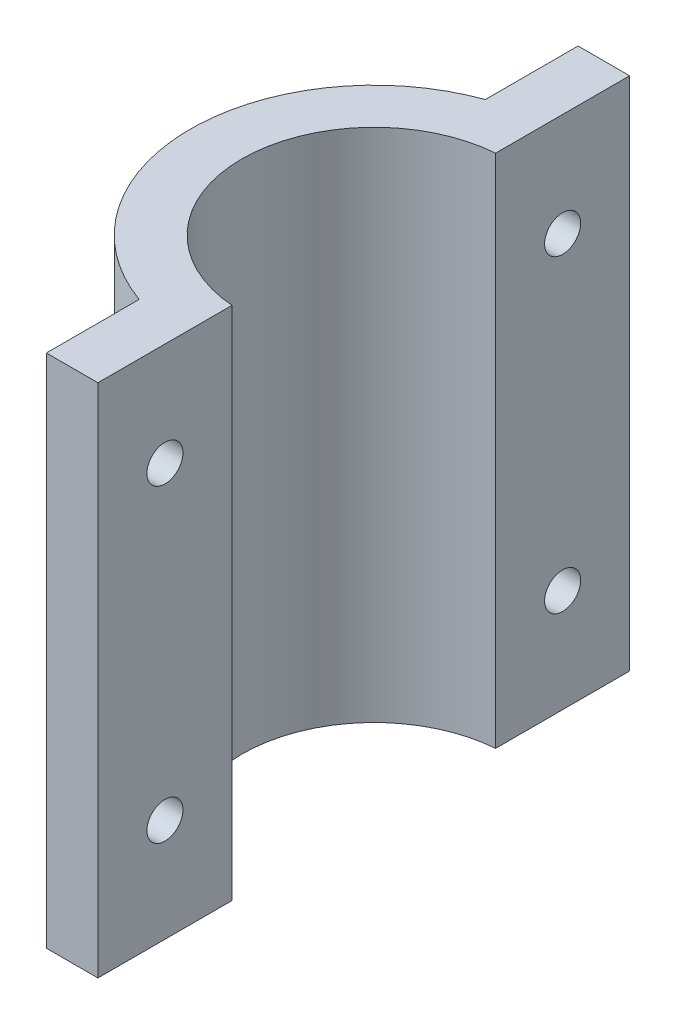
ISO-10303-21;
HEADER;
FILE_DESCRIPTION(('STEP AP214'),'2;1');
FILE_NAME('part.step','',(''),(''),'','','');
FILE_SCHEMA(('AUTOMOTIVE_DESIGN { 1 0 10303 214 1 1 1 1 }'));
ENDSEC;
DATA;
#1=APPLICATION_CONTEXT('core data for automotive mechanical design processes');
#2=APPLICATION_PROTOCOL_DEFINITION('international standard','automotive_design',2000,#1);
#3=PRODUCT_CONTEXT('',#1,'mechanical');
#4=PRODUCT('Part','Part','',(#3));
#5=PRODUCT_RELATED_PRODUCT_CATEGORY('part','',(#4));
#6=PRODUCT_DEFINITION_FORMATION('','',#4);
#7=PRODUCT_DEFINITION_CONTEXT('part definition',#1,'design');
#8=PRODUCT_DEFINITION('design','',#6,#7);
#9=PRODUCT_DEFINITION_SHAPE('','',#8);
#10=(LENGTH_UNIT() NAMED_UNIT(*) SI_UNIT(.MILLI.,.METRE.));
#11=(NAMED_UNIT(*) PLANE_ANGLE_UNIT() SI_UNIT($,.RADIAN.));
#12=(NAMED_UNIT(*) SI_UNIT($,.STERADIAN.) SOLID_ANGLE_UNIT());
#13=UNCERTAINTY_MEASURE_WITH_UNIT(LENGTH_MEASURE(1.E-05),#10,'distance_accuracy_value','');
#14=(GEOMETRIC_REPRESENTATION_CONTEXT(3) GLOBAL_UNCERTAINTY_ASSIGNED_CONTEXT((#13)) GLOBAL_UNIT_ASSIGNED_CONTEXT((#10,
#11,#12)) REPRESENTATION_CONTEXT('',''));
#15=CARTESIAN_POINT('',(0.,0.,0.));
#16=DIRECTION('',(0.,0.,1.));
#17=DIRECTION('',(1.,0.,0.));
#18=AXIS2_PLACEMENT_3D('',#15,#16,#17);
#19=CARTESIAN_POINT('',(-1.,-50.,25.7848331835619));
#20=DIRECTION('',(0.,0.,-1.));
#21=DIRECTION('',(-1.,0.,0.));
#22=AXIS2_PLACEMENT_3D('',#19,#20,#21);
#23=PLANE('',#22);
#24=DIRECTION('',(-1.,0.,0.));
#25=VECTOR('',#24,1.);
#26=CARTESIAN_POINT('',(-1.,0.,25.7848331835619));
#27=LINE('',#26,#25);
#28=CARTESIAN_POINT('',(-1.,0.,25.7848331835619));
#29=VERTEX_POINT('',#28);
#30=CARTESIAN_POINT('',(-6.,0.,25.7848331835619));
#31=VERTEX_POINT('',#30);
#32=EDGE_CURVE('E146',#29,#31,#27,.T.);
#33=ORIENTED_EDGE('',*,*,#32,.T.);
#34=DIRECTION('',(0.,1.,0.));
#35=VECTOR('',#34,1.);
#36=CARTESIAN_POINT('',(-6.,-50.,25.7848331835619));
#37=LINE('',#36,#35);
#38=CARTESIAN_POINT('',(-6.,-50.,25.7848331835619));
#39=VERTEX_POINT('',#38);
#40=EDGE_CURVE('E11',#39,#31,#37,.T.);
#41=ORIENTED_EDGE('',*,*,#40,.F.);
#42=DIRECTION('',(-1.,0.,0.));
#43=VECTOR('',#42,1.);
#44=CARTESIAN_POINT('',(-1.,-50.,25.7848331835619));
#45=LINE('',#44,#43);
#46=CARTESIAN_POINT('',(-1.,-50.,25.7848331835619));
#47=VERTEX_POINT('',#46);
#48=EDGE_CURVE('E169',#47,#39,#45,.T.);
#49=ORIENTED_EDGE('',*,*,#48,.F.);
#50=DIRECTION('',(0.,1.,0.));
#51=VECTOR('',#50,1.);
#52=CARTESIAN_POINT('',(-1.,-50.,25.7848331835619));
#53=LINE('',#52,#51);
#54=EDGE_CURVE('E142',#47,#29,#53,.T.);
#55=ORIENTED_EDGE('',*,*,#54,.T.);
#56=EDGE_LOOP('',(#33,#41,#49,#55));
#57=FACE_BOUND('',#56,.T.);
#58=ADVANCED_FACE('F45',(#57),#23,.F.);
#59=CARTESIAN_POINT('',(-6.,-50.,25.7848331835619));
#60=DIRECTION('',(1.,0.,0.));
#61=DIRECTION('',(0.,0.,-1.));
#62=AXIS2_PLACEMENT_3D('',#59,#60,#61);
#63=PLANE('',#62);
#64=CARTESIAN_POINT('',(-6.,-40.,19.2853936956035));
#65=DIRECTION('',(1.,0.,0.));
#66=DIRECTION('',(0.,0.,-1.));
#67=AXIS2_PLACEMENT_3D('',#64,#65,#66);
#68=CIRCLE('',#67,1.75);
#69=CARTESIAN_POINT('',(-6.,-40.,17.5353936956035));
#70=VERTEX_POINT('',#69);
#71=EDGE_CURVE('E220',#70,#70,#68,.T.);
#72=ORIENTED_EDGE('',*,*,#71,.T.);
#73=EDGE_LOOP('',(#72));
#74=FACE_BOUND('',#73,.T.);
#75=CARTESIAN_POINT('',(-6.,-10.,19.2853936956035));
#76=DIRECTION('',(1.,0.,0.));
#77=DIRECTION('',(0.,0.,-1.));
#78=AXIS2_PLACEMENT_3D('',#75,#76,#77);
#79=CIRCLE('',#78,1.75);
#80=CARTESIAN_POINT('',(-6.,-10.,17.5353936956035));
#81=VERTEX_POINT('',#80);
#82=EDGE_CURVE('E224',#81,#81,#79,.T.);
#83=ORIENTED_EDGE('',*,*,#82,.T.);
#84=EDGE_LOOP('',(#83));
#85=FACE_BOUND('',#84,.T.);
#86=DIRECTION('',(0.,0.,-1.));
#87=VECTOR('',#86,1.);
#88=CARTESIAN_POINT('',(-6.,0.,25.7848331835619));
#89=LINE('',#88,#87);
#90=CARTESIAN_POINT('',(-5.99999999999999,0.,16.7848331835619));
#91=VERTEX_POINT('',#90);
#92=EDGE_CURVE('E150',#31,#91,#89,.T.);
#93=ORIENTED_EDGE('',*,*,#92,.T.);
#94=DIRECTION('',(0.,1.,0.));
#95=VECTOR('',#94,1.);
#96=CARTESIAN_POINT('',(-5.99999999999999,-50.,16.7848331835619));
#97=LINE('',#96,#95);
#98=CARTESIAN_POINT('',(-5.99999999999999,-50.,16.7848331835619));
#99=VERTEX_POINT('',#98);
#100=EDGE_CURVE('E54',#99,#91,#97,.T.);
#101=ORIENTED_EDGE('',*,*,#100,.F.);
#102=DIRECTION('',(0.,0.,-1.));
#103=VECTOR('',#102,1.);
#104=CARTESIAN_POINT('',(-6.,-50.,25.7848331835619));
#105=LINE('',#104,#103);
#106=EDGE_CURVE('E105',#39,#99,#105,.T.);
#107=ORIENTED_EDGE('',*,*,#106,.F.);
#108=ORIENTED_EDGE('',*,*,#40,.T.);
#109=EDGE_LOOP('',(#93,#101,#107,#108));
#110=FACE_BOUND('',#109,.T.);
#111=ADVANCED_FACE('F260',(#74,#85,#110),#63,.F.);
#112=CARTESIAN_POINT('',(0.,-50.,0.));
#113=DIRECTION('',(0.,1.,0.));
#114=DIRECTION('',(0.,0.,1.));
#115=AXIS2_PLACEMENT_3D('',#112,#113,#114);
#116=CYLINDRICAL_SURFACE('',#115,17.825);
#117=CARTESIAN_POINT('',(0.,0.,0.));
#118=DIRECTION('',(0.,-1.,0.));
#119=DIRECTION('',(0.,0.,-1.));
#120=AXIS2_PLACEMENT_3D('',#117,#118,#119);
#121=CIRCLE('',#120,17.825);
#122=CARTESIAN_POINT('',(-6.,0.,-16.7848331835619));
#123=VERTEX_POINT('',#122);
#124=EDGE_CURVE('E154',#91,#123,#121,.T.);
#125=ORIENTED_EDGE('',*,*,#124,.T.);
#126=DIRECTION('',(0.,1.,0.));
#127=VECTOR('',#126,1.);
#128=CARTESIAN_POINT('',(-6.,-50.,-16.7848331835619));
#129=LINE('',#128,#127);
#130=CARTESIAN_POINT('',(-6.,-50.,-16.7848331835619));
#131=VERTEX_POINT('',#130);
#132=EDGE_CURVE('E180',#131,#123,#129,.T.);
#133=ORIENTED_EDGE('',*,*,#132,.F.);
#134=CARTESIAN_POINT('',(0.,-50.,0.));
#135=DIRECTION('',(0.,-1.,0.));
#136=DIRECTION('',(0.,0.,-1.));
#137=AXIS2_PLACEMENT_3D('',#134,#135,#136);
#138=CIRCLE('',#137,17.825);
#139=EDGE_CURVE('E190',#99,#131,#138,.T.);
#140=ORIENTED_EDGE('',*,*,#139,.F.);
#141=ORIENTED_EDGE('',*,*,#100,.T.);
#142=EDGE_LOOP('',(#125,#133,#140,#141));
#143=FACE_BOUND('',#142,.T.);
#144=ADVANCED_FACE('F188',(#143),#116,.T.);
#145=CARTESIAN_POINT('',(-6.,-50.,-16.7848331835619));
#146=DIRECTION('',(1.,0.,0.));
#147=DIRECTION('',(0.,0.,-1.));
#148=AXIS2_PLACEMENT_3D('',#145,#146,#147);
#149=PLANE('',#148);
#150=CARTESIAN_POINT('',(-6.,-10.,-19.2853936956035));
#151=DIRECTION('',(1.,0.,0.));
#152=DIRECTION('',(0.,0.,-1.));
#153=AXIS2_PLACEMENT_3D('',#150,#151,#152);
#154=CIRCLE('',#153,1.75000000000001);
#155=CARTESIAN_POINT('',(-6.,-10.,-21.0353936956035));
#156=VERTEX_POINT('',#155);
#157=EDGE_CURVE('E151',#156,#156,#154,.T.);
#158=ORIENTED_EDGE('',*,*,#157,.T.);
#159=EDGE_LOOP('',(#158));
#160=FACE_BOUND('',#159,.T.);
#161=CARTESIAN_POINT('',(-6.,-40.,-19.2853936956035));
#162=DIRECTION('',(1.,0.,0.));
#163=DIRECTION('',(0.,0.,-1.));
#164=AXIS2_PLACEMENT_3D('',#161,#162,#163);
#165=CIRCLE('',#164,1.75000000000001);
#166=CARTESIAN_POINT('',(-6.,-40.,-21.0353936956036));
#167=VERTEX_POINT('',#166);
#168=EDGE_CURVE('E216',#167,#167,#165,.T.);
#169=ORIENTED_EDGE('',*,*,#168,.T.);
#170=EDGE_LOOP('',(#169));
#171=FACE_BOUND('',#170,.T.);
#172=DIRECTION('',(0.,0.,-1.));
#173=VECTOR('',#172,1.);
#174=CARTESIAN_POINT('',(-6.,0.,-16.7848331835619));
#175=LINE('',#174,#173);
#176=CARTESIAN_POINT('',(-6.,0.,-25.7848331835619));
#177=VERTEX_POINT('',#176);
#178=EDGE_CURVE('E157',#123,#177,#175,.T.);
#179=ORIENTED_EDGE('',*,*,#178,.T.);
#180=DIRECTION('',(0.,1.,0.));
#181=VECTOR('',#180,1.);
#182=CARTESIAN_POINT('',(-6.,-50.,-25.7848331835619));
#183=LINE('',#182,#181);
#184=CARTESIAN_POINT('',(-6.,-50.,-25.7848331835619));
#185=VERTEX_POINT('',#184);
#186=EDGE_CURVE('E176',#185,#177,#183,.T.);
#187=ORIENTED_EDGE('',*,*,#186,.F.);
#188=DIRECTION('',(0.,0.,-1.));
#189=VECTOR('',#188,1.);
#190=CARTESIAN_POINT('',(-6.,-50.,-16.7848331835619));
#191=LINE('',#190,#189);
#192=EDGE_CURVE('E203',#131,#185,#191,.T.);
#193=ORIENTED_EDGE('',*,*,#192,.F.);
#194=ORIENTED_EDGE('',*,*,#132,.T.);
#195=EDGE_LOOP('',(#179,#187,#193,#194));
#196=FACE_BOUND('',#195,.T.);
#197=ADVANCED_FACE('F198',(#160,#171,#196),#149,.F.);
#198=CARTESIAN_POINT('',(-6.,-50.,-25.7848331835619));
#199=DIRECTION('',(0.,0.,1.));
#200=DIRECTION('',(1.,0.,0.));
#201=AXIS2_PLACEMENT_3D('',#198,#199,#200);
#202=PLANE('',#201);
#203=DIRECTION('',(1.,0.,0.));
#204=VECTOR('',#203,1.);
#205=CARTESIAN_POINT('',(-6.,0.,-25.7848331835619));
#206=LINE('',#205,#204);
#207=CARTESIAN_POINT('',(-1.,0.,-25.7848331835619));
#208=VERTEX_POINT('',#207);
#209=EDGE_CURVE('E160',#177,#208,#206,.T.);
#210=ORIENTED_EDGE('',*,*,#209,.T.);
#211=DIRECTION('',(0.,1.,0.));
#212=VECTOR('',#211,1.);
#213=CARTESIAN_POINT('',(-1.,-50.,-25.7848331835619));
#214=LINE('',#213,#212);
#215=CARTESIAN_POINT('',(-1.,-50.,-25.7848331835619));
#216=VERTEX_POINT('',#215);
#217=EDGE_CURVE('E135',#216,#208,#214,.T.);
#218=ORIENTED_EDGE('',*,*,#217,.F.);
#219=DIRECTION('',(1.,0.,0.));
#220=VECTOR('',#219,1.);
#221=CARTESIAN_POINT('',(-6.,-50.,-25.7848331835619));
#222=LINE('',#221,#220);
#223=EDGE_CURVE('E124',#185,#216,#222,.T.);
#224=ORIENTED_EDGE('',*,*,#223,.F.);
#225=ORIENTED_EDGE('',*,*,#186,.T.);
#226=EDGE_LOOP('',(#210,#218,#224,#225));
#227=FACE_BOUND('',#226,.T.);
#228=ADVANCED_FACE('F201',(#227),#202,.F.);
#229=CARTESIAN_POINT('',(-1.,-50.,-25.7848331835619));
#230=DIRECTION('',(-1.,0.,0.));
#231=DIRECTION('',(0.,0.,1.));
#232=AXIS2_PLACEMENT_3D('',#229,#230,#231);
#233=PLANE('',#232);
#234=CARTESIAN_POINT('',(-1.,-10.,-19.2853936956035));
#235=DIRECTION('',(1.,0.,0.));
#236=DIRECTION('',(0.,0.,1.));
#237=AXIS2_PLACEMENT_3D('',#234,#235,#236);
#238=CIRCLE('',#237,1.75000000000001);
#239=CARTESIAN_POINT('',(-1.,-10.,-17.5353936956035));
#240=VERTEX_POINT('',#239);
#241=EDGE_CURVE('E233',#240,#240,#238,.T.);
#242=ORIENTED_EDGE('',*,*,#241,.F.);
#243=EDGE_LOOP('',(#242));
#244=FACE_BOUND('',#243,.T.);
#245=CARTESIAN_POINT('',(-1.,-40.,-19.2853936956035));
#246=DIRECTION('',(1.,0.,0.));
#247=DIRECTION('',(0.,0.,-1.));
#248=AXIS2_PLACEMENT_3D('',#245,#246,#247);
#249=CIRCLE('',#248,1.75000000000001);
#250=CARTESIAN_POINT('',(-1.,-40.,-21.0353936956036));
#251=VERTEX_POINT('',#250);
#252=EDGE_CURVE('E237',#251,#251,#249,.T.);
#253=ORIENTED_EDGE('',*,*,#252,.F.);
#254=EDGE_LOOP('',(#253));
#255=FACE_BOUND('',#254,.T.);
#256=DIRECTION('',(0.,0.,1.));
#257=VECTOR('',#256,1.);
#258=CARTESIAN_POINT('',(-1.,0.,-25.7848331835619));
#259=LINE('',#258,#257);
#260=CARTESIAN_POINT('',(-1.00000000000001,0.,-12.7859542076452));
#261=VERTEX_POINT('',#260);
#262=EDGE_CURVE('E133',#208,#261,#259,.T.);
#263=ORIENTED_EDGE('',*,*,#262,.T.);
#264=DIRECTION('',(0.,1.,0.));
#265=VECTOR('',#264,1.);
#266=CARTESIAN_POINT('',(-1.00000000000001,-50.,-12.7859542076452));
#267=LINE('',#266,#265);
#268=CARTESIAN_POINT('',(-1.00000000000001,-50.,-12.7859542076452));
#269=VERTEX_POINT('',#268);
#270=EDGE_CURVE('E130',#269,#261,#267,.T.);
#271=ORIENTED_EDGE('',*,*,#270,.F.);
#272=DIRECTION('',(0.,0.,1.));
#273=VECTOR('',#272,1.);
#274=CARTESIAN_POINT('',(-1.,-50.,-25.7848331835619));
#275=LINE('',#274,#273);
#276=EDGE_CURVE('E118',#216,#269,#275,.T.);
#277=ORIENTED_EDGE('',*,*,#276,.F.);
#278=ORIENTED_EDGE('',*,*,#217,.T.);
#279=EDGE_LOOP('',(#263,#271,#277,#278));
#280=FACE_BOUND('',#279,.T.);
#281=ADVANCED_FACE('F131',(#244,#255,#280),#233,.F.);
#282=CARTESIAN_POINT('',(0.,-50.,0.));
#283=DIRECTION('',(0.,1.,0.));
#284=DIRECTION('',(0.,0.,1.));
#285=AXIS2_PLACEMENT_3D('',#282,#283,#284);
#286=CYLINDRICAL_SURFACE('',#285,12.825);
#287=CARTESIAN_POINT('',(0.,0.,0.));
#288=DIRECTION('',(0.,1.,0.));
#289=DIRECTION('',(0.,0.,-1.));
#290=AXIS2_PLACEMENT_3D('',#287,#288,#289);
#291=CIRCLE('',#290,12.825);
#292=CARTESIAN_POINT('',(-1.,0.,12.7859542076452));
#293=VERTEX_POINT('',#292);
#294=EDGE_CURVE('E91',#261,#293,#291,.T.);
#295=ORIENTED_EDGE('',*,*,#294,.T.);
#296=DIRECTION('',(0.,1.,0.));
#297=VECTOR('',#296,1.);
#298=CARTESIAN_POINT('',(-1.,-50.,12.7859542076452));
#299=LINE('',#298,#297);
#300=CARTESIAN_POINT('',(-1.,-50.,12.7859542076452));
#301=VERTEX_POINT('',#300);
#302=EDGE_CURVE('E136',#301,#293,#299,.T.);
#303=ORIENTED_EDGE('',*,*,#302,.F.);
#304=CARTESIAN_POINT('',(0.,-50.,0.));
#305=DIRECTION('',(0.,1.,0.));
#306=DIRECTION('',(0.,0.,-1.));
#307=AXIS2_PLACEMENT_3D('',#304,#305,#306);
#308=CIRCLE('',#307,12.825);
#309=EDGE_CURVE('E122',#269,#301,#308,.T.);
#310=ORIENTED_EDGE('',*,*,#309,.F.);
#311=ORIENTED_EDGE('',*,*,#270,.T.);
#312=EDGE_LOOP('',(#295,#303,#310,#311));
#313=FACE_BOUND('',#312,.T.);
#314=ADVANCED_FACE('F138',(#313),#286,.F.);
#315=CARTESIAN_POINT('',(-1.,-50.,25.7848331835619));
#316=DIRECTION('',(-1.,0.,0.));
#317=DIRECTION('',(0.,0.,1.));
#318=AXIS2_PLACEMENT_3D('',#315,#316,#317);
#319=PLANE('',#318);
#320=CARTESIAN_POINT('',(-1.,-40.,19.2853936956035));
#321=DIRECTION('',(1.,0.,0.));
#322=DIRECTION('',(0.,0.,1.));
#323=AXIS2_PLACEMENT_3D('',#320,#321,#322);
#324=CIRCLE('',#323,1.75);
#325=CARTESIAN_POINT('',(-1.,-40.,21.0353936956035));
#326=VERTEX_POINT('',#325);
#327=EDGE_CURVE('E232',#326,#326,#324,.T.);
#328=ORIENTED_EDGE('',*,*,#327,.F.);
#329=EDGE_LOOP('',(#328));
#330=FACE_BOUND('',#329,.T.);
#331=CARTESIAN_POINT('',(-1.,-10.,19.2853936956035));
#332=DIRECTION('',(1.,0.,0.));
#333=DIRECTION('',(0.,0.,-1.));
#334=AXIS2_PLACEMENT_3D('',#331,#332,#333);
#335=CIRCLE('',#334,1.75);
#336=CARTESIAN_POINT('',(-1.,-10.,17.5353936956035));
#337=VERTEX_POINT('',#336);
#338=EDGE_CURVE('E228',#337,#337,#335,.T.);
#339=ORIENTED_EDGE('',*,*,#338,.F.);
#340=EDGE_LOOP('',(#339));
#341=FACE_BOUND('',#340,.T.);
#342=DIRECTION('',(0.,0.,1.));
#343=VECTOR('',#342,1.);
#344=CARTESIAN_POINT('',(-1.,0.,25.7848331835619));
#345=LINE('',#344,#343);
#346=EDGE_CURVE('E97',#293,#29,#345,.T.);
#347=ORIENTED_EDGE('',*,*,#346,.T.);
#348=ORIENTED_EDGE('',*,*,#54,.F.);
#349=DIRECTION('',(0.,0.,1.));
#350=VECTOR('',#349,1.);
#351=CARTESIAN_POINT('',(-1.,-50.,25.7848331835619));
#352=LINE('',#351,#350);
#353=EDGE_CURVE('E62',#301,#47,#352,.T.);
#354=ORIENTED_EDGE('',*,*,#353,.F.);
#355=ORIENTED_EDGE('',*,*,#302,.T.);
#356=EDGE_LOOP('',(#347,#348,#354,#355));
#357=FACE_BOUND('',#356,.T.);
#358=ADVANCED_FACE('F248',(#330,#341,#357),#319,.F.);
#359=CARTESIAN_POINT('',(0.,-50.,0.));
#360=DIRECTION('',(0.,-1.,0.));
#361=DIRECTION('',(0.,0.,-1.));
#362=AXIS2_PLACEMENT_3D('',#359,#360,#361);
#363=PLANE('',#362);
#364=ORIENTED_EDGE('',*,*,#48,.T.);
#365=ORIENTED_EDGE('',*,*,#106,.T.);
#366=ORIENTED_EDGE('',*,*,#139,.T.);
#367=ORIENTED_EDGE('',*,*,#192,.T.);
#368=ORIENTED_EDGE('',*,*,#223,.T.);
#369=ORIENTED_EDGE('',*,*,#276,.T.);
#370=ORIENTED_EDGE('',*,*,#309,.T.);
#371=ORIENTED_EDGE('',*,*,#353,.T.);
#372=EDGE_LOOP('',(#364,#365,#366,#367,#368,#369,#370,#371));
#373=FACE_BOUND('',#372,.T.);
#374=ADVANCED_FACE('F120',(#373),#363,.T.);
#375=CARTESIAN_POINT('',(0.,0.,0.));
#376=DIRECTION('',(0.,-1.,0.));
#377=DIRECTION('',(0.,0.,-1.));
#378=AXIS2_PLACEMENT_3D('',#375,#376,#377);
#379=PLANE('',#378);
#380=ORIENTED_EDGE('',*,*,#32,.F.);
#381=ORIENTED_EDGE('',*,*,#346,.F.);
#382=ORIENTED_EDGE('',*,*,#294,.F.);
#383=ORIENTED_EDGE('',*,*,#262,.F.);
#384=ORIENTED_EDGE('',*,*,#209,.F.);
#385=ORIENTED_EDGE('',*,*,#178,.F.);
#386=ORIENTED_EDGE('',*,*,#124,.F.);
#387=ORIENTED_EDGE('',*,*,#92,.F.);
#388=EDGE_LOOP('',(#380,#381,#382,#383,#384,#385,#386,#387));
#389=FACE_BOUND('',#388,.T.);
#390=ADVANCED_FACE('F194',(#389),#379,.F.);
#391=CARTESIAN_POINT('',(-17.825,-10.,19.2853936956035));
#392=DIRECTION('',(1.,0.,0.));
#393=DIRECTION('',(0.,0.,-1.));
#394=AXIS2_PLACEMENT_3D('',#391,#392,#393);
#395=CYLINDRICAL_SURFACE('',#394,1.75);
#396=ORIENTED_EDGE('',*,*,#338,.T.);
#397=EDGE_LOOP('',(#396));
#398=FACE_BOUND('',#397,.T.);
#399=ORIENTED_EDGE('',*,*,#82,.F.);
#400=EDGE_LOOP('',(#399));
#401=FACE_BOUND('',#400,.T.);
#402=ADVANCED_FACE('F254',(#398,#401),#395,.F.);
#403=CARTESIAN_POINT('',(-17.825,-40.,19.2853936956035));
#404=DIRECTION('',(1.,0.,0.));
#405=DIRECTION('',(0.,0.,-1.));
#406=AXIS2_PLACEMENT_3D('',#403,#404,#405);
#407=CYLINDRICAL_SURFACE('',#406,1.75);
#408=ORIENTED_EDGE('',*,*,#327,.T.);
#409=EDGE_LOOP('',(#408));
#410=FACE_BOUND('',#409,.T.);
#411=ORIENTED_EDGE('',*,*,#71,.F.);
#412=EDGE_LOOP('',(#411));
#413=FACE_BOUND('',#412,.T.);
#414=ADVANCED_FACE('F245',(#410,#413),#407,.F.);
#415=CARTESIAN_POINT('',(-17.825,-40.,-19.2853936956035));
#416=DIRECTION('',(1.,0.,0.));
#417=DIRECTION('',(0.,0.,-1.));
#418=AXIS2_PLACEMENT_3D('',#415,#416,#417);
#419=CYLINDRICAL_SURFACE('',#418,1.75000000000001);
#420=ORIENTED_EDGE('',*,*,#252,.T.);
#421=EDGE_LOOP('',(#420));
#422=FACE_BOUND('',#421,.T.);
#423=ORIENTED_EDGE('',*,*,#168,.F.);
#424=EDGE_LOOP('',(#423));
#425=FACE_BOUND('',#424,.T.);
#426=ADVANCED_FACE('F342',(#422,#425),#419,.F.);
#427=CARTESIAN_POINT('',(-17.825,-10.,-19.2853936956035));
#428=DIRECTION('',(1.,0.,0.));
#429=DIRECTION('',(0.,0.,-1.));
#430=AXIS2_PLACEMENT_3D('',#427,#428,#429);
#431=CYLINDRICAL_SURFACE('',#430,1.75000000000001);
#432=ORIENTED_EDGE('',*,*,#241,.T.);
#433=EDGE_LOOP('',(#432));
#434=FACE_BOUND('',#433,.T.);
#435=ORIENTED_EDGE('',*,*,#157,.F.);
#436=EDGE_LOOP('',(#435));
#437=FACE_BOUND('',#436,.T.);
#438=ADVANCED_FACE('F350',(#434,#437),#431,.F.);
#439=CLOSED_SHELL('',(#58,#111,#144,#197,#228,#281,#314,#358,#374,#390,#402,#414,#426,#438));
#440=MANIFOLD_SOLID_BREP('B2',#439);
#441=ADVANCED_BREP_SHAPE_REPRESENTATION('',(#18,#440),#14);
#442=SHAPE_DEFINITION_REPRESENTATION(#9,#441);
ENDSEC;
END-ISO-10303-21;
